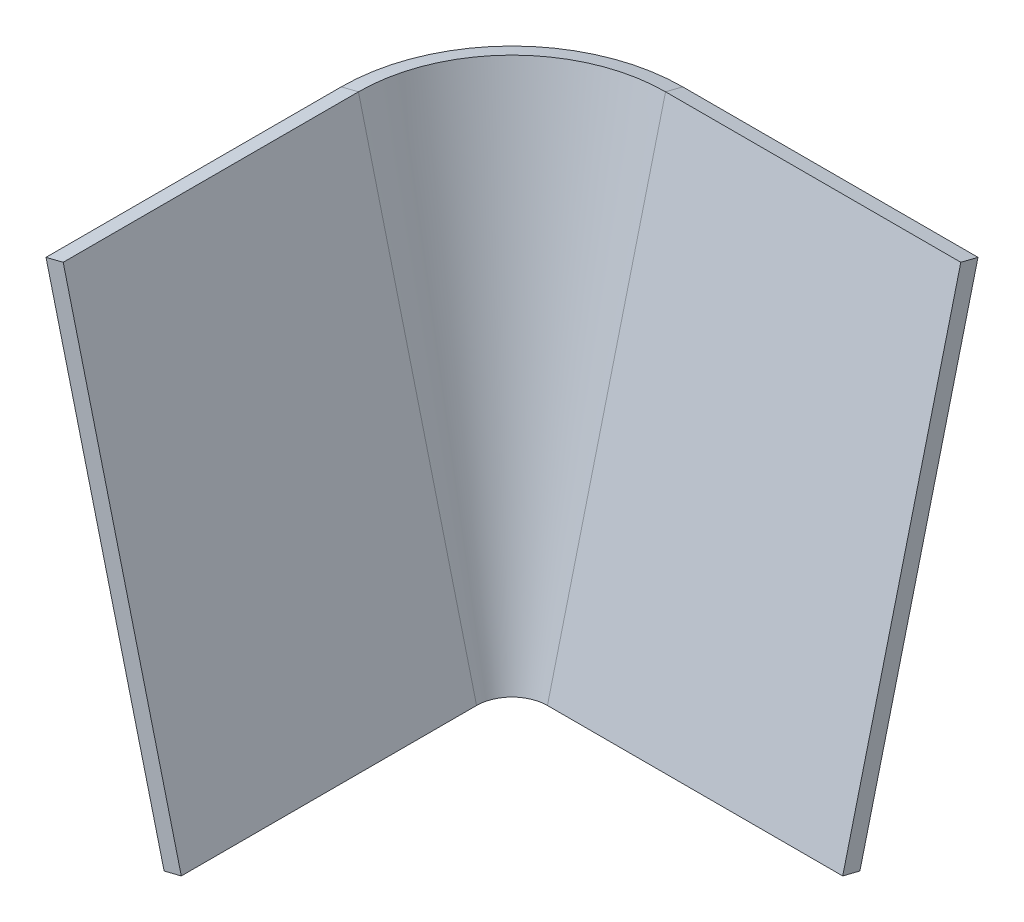
ISO-10303-21;
HEADER;
FILE_DESCRIPTION(('STEP AP214'),'2;1');
FILE_NAME('part.step','',(''),(''),'','','');
FILE_SCHEMA(('AUTOMOTIVE_DESIGN { 1 0 10303 214 1 1 1 1 }'));
ENDSEC;
DATA;
#1=APPLICATION_CONTEXT('core data for automotive mechanical design processes');
#2=APPLICATION_PROTOCOL_DEFINITION('international standard','automotive_design',2000,#1);
#3=PRODUCT_CONTEXT('',#1,'mechanical');
#4=PRODUCT('Part','Part','',(#3));
#5=PRODUCT_RELATED_PRODUCT_CATEGORY('part','',(#4));
#6=PRODUCT_DEFINITION_FORMATION('','',#4);
#7=PRODUCT_DEFINITION_CONTEXT('part definition',#1,'design');
#8=PRODUCT_DEFINITION('design','',#6,#7);
#9=PRODUCT_DEFINITION_SHAPE('','',#8);
#10=(LENGTH_UNIT() NAMED_UNIT(*) SI_UNIT(.MILLI.,.METRE.));
#11=(NAMED_UNIT(*) PLANE_ANGLE_UNIT() SI_UNIT($,.RADIAN.));
#12=(NAMED_UNIT(*) SI_UNIT($,.STERADIAN.) SOLID_ANGLE_UNIT());
#13=UNCERTAINTY_MEASURE_WITH_UNIT(LENGTH_MEASURE(1.E-05),#10,'distance_accuracy_value','');
#14=(GEOMETRIC_REPRESENTATION_CONTEXT(3) GLOBAL_UNCERTAINTY_ASSIGNED_CONTEXT((#13)) GLOBAL_UNIT_ASSIGNED_CONTEXT((#10,
#11,#12)) REPRESENTATION_CONTEXT('',''));
#15=CARTESIAN_POINT('',(0.,0.,0.));
#16=DIRECTION('',(0.,0.,1.));
#17=DIRECTION('',(1.,0.,0.));
#18=AXIS2_PLACEMENT_3D('',#15,#16,#17);
#19=CARTESIAN_POINT('',(-20.,80.,56.));
#20=DIRECTION('',(0.242535625036333,-0.970142500145332,0.));
#21=DIRECTION('',(0.,0.,-1.));
#22=AXIS2_PLACEMENT_3D('',#19,#20,#21);
#23=PLANE('',#22);
#24=DIRECTION('',(-0.970142500145332,-0.242535625036333,0.));
#25=VECTOR('',#24,1.);
#26=CARTESIAN_POINT('',(-20.,80.,56.));
#27=LINE('',#26,#25);
#28=CARTESIAN_POINT('',(-20.,80.,56.));
#29=VERTEX_POINT('',#28);
#30=CARTESIAN_POINT('',(-22.910427500436,79.272393124891,56.));
#31=VERTEX_POINT('',#30);
#32=EDGE_CURVE('E12',#29,#31,#27,.T.);
#33=ORIENTED_EDGE('',*,*,#32,.F.);
#34=DIRECTION('',(0.,0.,-1.));
#35=VECTOR('',#34,1.);
#36=CARTESIAN_POINT('',(-20.,80.,56.));
#37=LINE('',#36,#35);
#38=CARTESIAN_POINT('',(-20.,80.,6.00000000000016));
#39=VERTEX_POINT('',#38);
#40=EDGE_CURVE('E146',#29,#39,#37,.T.);
#41=ORIENTED_EDGE('',*,*,#40,.T.);
#42=DIRECTION('',(-0.970142500145332,-0.242535625036333,0.));
#43=VECTOR('',#42,1.);
#44=CARTESIAN_POINT('',(-20.,80.,6.00000000000016));
#45=LINE('',#44,#43);
#46=CARTESIAN_POINT('',(-22.910427500436,79.272393124891,6.00000000000016));
#47=VERTEX_POINT('',#46);
#48=EDGE_CURVE('E55',#39,#47,#45,.T.);
#49=ORIENTED_EDGE('',*,*,#48,.T.);
#50=DIRECTION('',(0.,0.,1.));
#51=VECTOR('',#50,1.);
#52=CARTESIAN_POINT('',(-22.910427500436,79.272393124891,0.));
#53=LINE('',#52,#51);
#54=EDGE_CURVE('E144',#31,#47,#53,.F.);
#55=ORIENTED_EDGE('',*,*,#54,.F.);
#56=EDGE_LOOP('',(#33,#41,#49,#55));
#57=FACE_BOUND('',#56,.T.);
#58=ADVANCED_FACE('F45',(#57),#23,.F.);
#59=CARTESIAN_POINT('',(6.,80.,6.));
#60=DIRECTION('',(0.,-1.,0.));
#61=DIRECTION('',(0.,0.,-1.));
#62=AXIS2_PLACEMENT_3D('',#59,#60,#61);
#63=CONICAL_SURFACE('',#62,26.,1.32581766366803);
#64=ORIENTED_EDGE('',*,*,#48,.F.);
#65=CARTESIAN_POINT('',(6.,80.,6.));
#66=DIRECTION('',(0.,-1.,0.));
#67=DIRECTION('',(0.,0.,-1.));
#68=AXIS2_PLACEMENT_3D('',#65,#66,#67);
#69=CIRCLE('',#68,26.);
#70=CARTESIAN_POINT('',(6.00000000000004,80.,-20.));
#71=VERTEX_POINT('',#70);
#72=EDGE_CURVE('E129',#39,#71,#69,.T.);
#73=ORIENTED_EDGE('',*,*,#72,.T.);
#74=DIRECTION('',(0.,-0.242535625036333,-0.970142500145332));
#75=VECTOR('',#74,1.);
#76=CARTESIAN_POINT('',(6.00000000000004,80.,-20.));
#77=LINE('',#76,#75);
#78=CARTESIAN_POINT('',(6.00000000000004,79.272393124891,-22.910427500436));
#79=VERTEX_POINT('',#78);
#80=EDGE_CURVE('E138',#71,#79,#77,.T.);
#81=ORIENTED_EDGE('',*,*,#80,.T.);
#82=CARTESIAN_POINT('',(6.,79.272393124891,6.));
#83=DIRECTION('',(0.,1.,0.));
#84=DIRECTION('',(0.,0.,1.));
#85=AXIS2_PLACEMENT_3D('',#82,#83,#84);
#86=CIRCLE('',#85,28.910427500436);
#87=EDGE_CURVE('E163',#47,#79,#86,.F.);
#88=ORIENTED_EDGE('',*,*,#87,.F.);
#89=EDGE_LOOP('',(#64,#73,#81,#88));
#90=FACE_BOUND('',#89,.T.);
#91=ADVANCED_FACE('F164',(#90),#63,.T.);
#92=CARTESIAN_POINT('',(6.00000000000004,80.,-20.));
#93=DIRECTION('',(0.,-0.970142500145332,0.242535625036333));
#94=DIRECTION('',(1.,0.,0.));
#95=AXIS2_PLACEMENT_3D('',#92,#93,#94);
#96=PLANE('',#95);
#97=ORIENTED_EDGE('',*,*,#80,.F.);
#98=DIRECTION('',(1.,0.,0.));
#99=VECTOR('',#98,1.);
#100=CARTESIAN_POINT('',(6.00000000000004,80.,-20.));
#101=LINE('',#100,#99);
#102=CARTESIAN_POINT('',(56.,80.,-20.));
#103=VERTEX_POINT('',#102);
#104=EDGE_CURVE('E124',#71,#103,#101,.T.);
#105=ORIENTED_EDGE('',*,*,#104,.T.);
#106=DIRECTION('',(0.,-0.242535625036333,-0.970142500145332));
#107=VECTOR('',#106,1.);
#108=CARTESIAN_POINT('',(56.,80.,-20.));
#109=LINE('',#108,#107);
#110=CARTESIAN_POINT('',(56.,79.272393124891,-22.910427500436));
#111=VERTEX_POINT('',#110);
#112=EDGE_CURVE('E102',#103,#111,#109,.T.);
#113=ORIENTED_EDGE('',*,*,#112,.T.);
#114=DIRECTION('',(1.,0.,0.));
#115=VECTOR('',#114,1.);
#116=CARTESIAN_POINT('',(0.,79.272393124891,-22.910427500436));
#117=LINE('',#116,#115);
#118=EDGE_CURVE('E182',#79,#111,#117,.T.);
#119=ORIENTED_EDGE('',*,*,#118,.F.);
#120=EDGE_LOOP('',(#97,#105,#113,#119));
#121=FACE_BOUND('',#120,.T.);
#122=ADVANCED_FACE('F201',(#121),#96,.F.);
#123=CARTESIAN_POINT('',(56.,80.,-20.));
#124=DIRECTION('',(-1.,0.,0.));
#125=DIRECTION('',(0.,-0.970142500145332,0.242535625036333));
#126=AXIS2_PLACEMENT_3D('',#123,#124,#125);
#127=PLANE('',#126);
#128=ORIENTED_EDGE('',*,*,#112,.F.);
#129=DIRECTION('',(0.,-0.970142500145332,0.242535625036333));
#130=VECTOR('',#129,1.);
#131=CARTESIAN_POINT('',(56.,80.,-20.));
#132=LINE('',#131,#130);
#133=CARTESIAN_POINT('',(56.,0.,0.));
#134=VERTEX_POINT('',#133);
#135=EDGE_CURVE('E119',#103,#134,#132,.T.);
#136=ORIENTED_EDGE('',*,*,#135,.T.);
#137=DIRECTION('',(0.,-0.242535625036333,-0.970142500145332));
#138=VECTOR('',#137,1.);
#139=CARTESIAN_POINT('',(56.,0.,0.));
#140=LINE('',#139,#138);
#141=CARTESIAN_POINT('',(56.,-0.727606875108999,-2.910427500436));
#142=VERTEX_POINT('',#141);
#143=EDGE_CURVE('E63',#134,#142,#140,.T.);
#144=ORIENTED_EDGE('',*,*,#143,.T.);
#145=DIRECTION('',(0.,-0.970142500145332,0.242535625036333));
#146=VECTOR('',#145,1.);
#147=CARTESIAN_POINT('',(56.,-0.727606875108999,-2.910427500436));
#148=LINE('',#147,#146);
#149=EDGE_CURVE('E180',#111,#142,#148,.T.);
#150=ORIENTED_EDGE('',*,*,#149,.F.);
#151=EDGE_LOOP('',(#128,#136,#144,#150));
#152=FACE_BOUND('',#151,.T.);
#153=ADVANCED_FACE('F126',(#152),#127,.F.);
#154=CARTESIAN_POINT('',(6.00000000000004,0.,0.));
#155=DIRECTION('',(0.,-0.970142500145332,0.242535625036333));
#156=DIRECTION('',(1.,0.,0.));
#157=AXIS2_PLACEMENT_3D('',#154,#155,#156);
#158=PLANE('',#157);
#159=ORIENTED_EDGE('',*,*,#143,.F.);
#160=DIRECTION('',(1.,0.,0.));
#161=VECTOR('',#160,1.);
#162=CARTESIAN_POINT('',(6.00000000000004,0.,0.));
#163=LINE('',#162,#161);
#164=CARTESIAN_POINT('',(6.,0.,0.));
#165=VERTEX_POINT('',#164);
#166=EDGE_CURVE('E110',#165,#134,#163,.T.);
#167=ORIENTED_EDGE('',*,*,#166,.F.);
#168=DIRECTION('',(0.,-0.242535625036333,-0.970142500145332));
#169=VECTOR('',#168,1.);
#170=CARTESIAN_POINT('',(6.,0.,0.));
#171=LINE('',#170,#169);
#172=CARTESIAN_POINT('',(6.00000000000001,-0.727606875108985,-2.910427500436));
#173=VERTEX_POINT('',#172);
#174=EDGE_CURVE('E113',#165,#173,#171,.T.);
#175=ORIENTED_EDGE('',*,*,#174,.T.);
#176=DIRECTION('',(1.,0.,0.));
#177=VECTOR('',#176,1.);
#178=CARTESIAN_POINT('',(0.,-0.727606875108985,-2.910427500436));
#179=LINE('',#178,#177);
#180=EDGE_CURVE('E112',#173,#142,#179,.T.);
#181=ORIENTED_EDGE('',*,*,#180,.T.);
#182=EDGE_LOOP('',(#159,#167,#175,#181));
#183=FACE_BOUND('',#182,.T.);
#184=ADVANCED_FACE('F108',(#183),#158,.T.);
#185=CARTESIAN_POINT('',(6.,0.,6.));
#186=DIRECTION('',(0.,-1.,0.));
#187=DIRECTION('',(0.,0.,-1.));
#188=AXIS2_PLACEMENT_3D('',#185,#186,#187);
#189=CONICAL_SURFACE('',#188,6.,1.32581766366803);
#190=ORIENTED_EDGE('',*,*,#174,.F.);
#191=CARTESIAN_POINT('',(6.,0.,6.));
#192=DIRECTION('',(0.,-1.,0.));
#193=DIRECTION('',(0.,0.,-1.));
#194=AXIS2_PLACEMENT_3D('',#191,#192,#193);
#195=CIRCLE('',#194,6.);
#196=CARTESIAN_POINT('',(0.,0.,6.00000000000004));
#197=VERTEX_POINT('',#196);
#198=EDGE_CURVE('E127',#197,#165,#195,.T.);
#199=ORIENTED_EDGE('',*,*,#198,.F.);
#200=DIRECTION('',(-0.970142500145332,-0.242535625036333,0.));
#201=VECTOR('',#200,1.);
#202=CARTESIAN_POINT('',(0.,0.,6.00000000000004));
#203=LINE('',#202,#201);
#204=CARTESIAN_POINT('',(-2.910427500436,-0.727606875108999,6.00000000000005));
#205=VERTEX_POINT('',#204);
#206=EDGE_CURVE('E133',#197,#205,#203,.T.);
#207=ORIENTED_EDGE('',*,*,#206,.T.);
#208=CARTESIAN_POINT('',(6.,-0.727606875109005,6.));
#209=DIRECTION('',(0.,1.,0.));
#210=DIRECTION('',(0.,0.,1.));
#211=AXIS2_PLACEMENT_3D('',#208,#209,#210);
#212=CIRCLE('',#211,8.910427500436);
#213=EDGE_CURVE('E168',#205,#173,#212,.F.);
#214=ORIENTED_EDGE('',*,*,#213,.T.);
#215=EDGE_LOOP('',(#190,#199,#207,#214));
#216=FACE_BOUND('',#215,.T.);
#217=ADVANCED_FACE('F206',(#216),#189,.F.);
#218=CARTESIAN_POINT('',(0.,0.,6.00000000000004));
#219=DIRECTION('',(0.242535625036333,-0.970142500145332,0.));
#220=DIRECTION('',(0.,0.,-1.));
#221=AXIS2_PLACEMENT_3D('',#218,#219,#220);
#222=PLANE('',#221);
#223=ORIENTED_EDGE('',*,*,#206,.F.);
#224=DIRECTION('',(0.,0.,-1.));
#225=VECTOR('',#224,1.);
#226=CARTESIAN_POINT('',(0.,0.,6.00000000000004));
#227=LINE('',#226,#225);
#228=CARTESIAN_POINT('',(0.,0.,56.));
#229=VERTEX_POINT('',#228);
#230=EDGE_CURVE('E191',#229,#197,#227,.T.);
#231=ORIENTED_EDGE('',*,*,#230,.F.);
#232=DIRECTION('',(-0.970142500145332,-0.242535625036333,0.));
#233=VECTOR('',#232,1.);
#234=CARTESIAN_POINT('',(0.,0.,56.));
#235=LINE('',#234,#233);
#236=CARTESIAN_POINT('',(-2.91042750043599,-0.727606875108985,56.));
#237=VERTEX_POINT('',#236);
#238=EDGE_CURVE('E49',#229,#237,#235,.T.);
#239=ORIENTED_EDGE('',*,*,#238,.T.);
#240=DIRECTION('',(0.,0.,1.));
#241=VECTOR('',#240,1.);
#242=CARTESIAN_POINT('',(-2.910427500436,-0.727606875108987,0.));
#243=LINE('',#242,#241);
#244=EDGE_CURVE('E174',#237,#205,#243,.F.);
#245=ORIENTED_EDGE('',*,*,#244,.T.);
#246=EDGE_LOOP('',(#223,#231,#239,#245));
#247=FACE_BOUND('',#246,.T.);
#248=ADVANCED_FACE('F233',(#247),#222,.T.);
#249=CARTESIAN_POINT('',(-20.,80.,56.));
#250=DIRECTION('',(0.,0.,1.));
#251=DIRECTION('',(0.242535625036333,-0.970142500145332,0.));
#252=AXIS2_PLACEMENT_3D('',#249,#250,#251);
#253=PLANE('',#252);
#254=DIRECTION('',(0.242535625036333,-0.970142500145332,0.));
#255=VECTOR('',#254,1.);
#256=CARTESIAN_POINT('',(-20.,80.,56.));
#257=LINE('',#256,#255);
#258=EDGE_CURVE('E188',#29,#229,#257,.T.);
#259=ORIENTED_EDGE('',*,*,#258,.F.);
#260=ORIENTED_EDGE('',*,*,#32,.T.);
#261=DIRECTION('',(-0.242535625036333,0.970142500145332,0.));
#262=VECTOR('',#261,1.);
#263=CARTESIAN_POINT('',(-2.91042750043599,-0.727606875108998,56.));
#264=LINE('',#263,#262);
#265=EDGE_CURVE('E159',#31,#237,#264,.F.);
#266=ORIENTED_EDGE('',*,*,#265,.T.);
#267=ORIENTED_EDGE('',*,*,#238,.F.);
#268=EDGE_LOOP('',(#259,#260,#266,#267));
#269=FACE_BOUND('',#268,.T.);
#270=ADVANCED_FACE('F47',(#269),#253,.T.);
#271=CARTESIAN_POINT('',(-2.910427500436,-0.727606875108999,0.));
#272=DIRECTION('',(0.970142500145332,0.242535625036333,0.));
#273=DIRECTION('',(-0.242535625036333,0.970142500145332,0.));
#274=AXIS2_PLACEMENT_3D('',#271,#272,#273);
#275=PLANE('',#274);
#276=DIRECTION('',(-0.242535625036333,0.970142500145332,0.));
#277=VECTOR('',#276,1.);
#278=CARTESIAN_POINT('',(-2.910427500436,-0.727606875108999,6.00000000000016));
#279=LINE('',#278,#277);
#280=EDGE_CURVE('E157',#47,#205,#279,.F.);
#281=ORIENTED_EDGE('',*,*,#280,.T.);
#282=ORIENTED_EDGE('',*,*,#244,.F.);
#283=ORIENTED_EDGE('',*,*,#265,.F.);
#284=ORIENTED_EDGE('',*,*,#54,.T.);
#285=EDGE_LOOP('',(#281,#282,#283,#284));
#286=FACE_BOUND('',#285,.T.);
#287=ADVANCED_FACE('F154',(#286),#275,.F.);
#288=CARTESIAN_POINT('',(6.,79.272393124891,6.));
#289=DIRECTION('',(0.,1.,0.));
#290=DIRECTION('',(0.,0.,1.));
#291=AXIS2_PLACEMENT_3D('',#288,#289,#290);
#292=CONICAL_SURFACE('',#291,28.910427500436,0.244978663126864);
#293=DIRECTION('',(0.,0.970142500145332,-0.242535625036333));
#294=VECTOR('',#293,1.);
#295=CARTESIAN_POINT('',(6.00000000000004,79.272393124891,-22.910427500436));
#296=LINE('',#295,#294);
#297=EDGE_CURVE('E160',#79,#173,#296,.F.);
#298=ORIENTED_EDGE('',*,*,#297,.T.);
#299=ORIENTED_EDGE('',*,*,#213,.F.);
#300=ORIENTED_EDGE('',*,*,#280,.F.);
#301=ORIENTED_EDGE('',*,*,#87,.T.);
#302=EDGE_LOOP('',(#298,#299,#300,#301));
#303=FACE_BOUND('',#302,.T.);
#304=ADVANCED_FACE('F171',(#303),#292,.T.);
#305=CARTESIAN_POINT('',(0.,-0.727606875108999,-2.910427500436));
#306=DIRECTION('',(0.,0.242535625036333,0.970142500145332));
#307=DIRECTION('',(0.,-0.970142500145332,0.242535625036333));
#308=AXIS2_PLACEMENT_3D('',#305,#306,#307);
#309=PLANE('',#308);
#310=ORIENTED_EDGE('',*,*,#149,.T.);
#311=ORIENTED_EDGE('',*,*,#180,.F.);
#312=ORIENTED_EDGE('',*,*,#297,.F.);
#313=ORIENTED_EDGE('',*,*,#118,.T.);
#314=EDGE_LOOP('',(#310,#311,#312,#313));
#315=FACE_BOUND('',#314,.T.);
#316=ADVANCED_FACE('F208',(#315),#309,.F.);
#317=CARTESIAN_POINT('',(0.,0.,0.));
#318=DIRECTION('',(0.970142500145332,0.242535625036333,0.));
#319=DIRECTION('',(-0.242535625036333,0.970142500145332,0.));
#320=AXIS2_PLACEMENT_3D('',#317,#318,#319);
#321=PLANE('',#320);
#322=DIRECTION('',(0.242535625036333,-0.970142500145332,0.));
#323=VECTOR('',#322,1.);
#324=CARTESIAN_POINT('',(-20.,80.,6.00000000000016));
#325=LINE('',#324,#323);
#326=EDGE_CURVE('E194',#39,#197,#325,.T.);
#327=ORIENTED_EDGE('',*,*,#326,.F.);
#328=ORIENTED_EDGE('',*,*,#40,.F.);
#329=ORIENTED_EDGE('',*,*,#258,.T.);
#330=ORIENTED_EDGE('',*,*,#230,.T.);
#331=EDGE_LOOP('',(#327,#328,#329,#330));
#332=FACE_BOUND('',#331,.T.);
#333=ADVANCED_FACE('F210',(#332),#321,.T.);
#334=CARTESIAN_POINT('',(6.,80.,6.));
#335=DIRECTION('',(0.,1.,0.));
#336=DIRECTION('',(0.,0.,1.));
#337=AXIS2_PLACEMENT_3D('',#334,#335,#336);
#338=CONICAL_SURFACE('',#337,26.,0.244978663126864);
#339=DIRECTION('',(0.,-0.970142500145332,0.242535625036333));
#340=VECTOR('',#339,1.);
#341=CARTESIAN_POINT('',(6.00000000000004,80.,-20.));
#342=LINE('',#341,#340);
#343=EDGE_CURVE('E122',#71,#165,#342,.T.);
#344=ORIENTED_EDGE('',*,*,#343,.F.);
#345=ORIENTED_EDGE('',*,*,#72,.F.);
#346=ORIENTED_EDGE('',*,*,#326,.T.);
#347=ORIENTED_EDGE('',*,*,#198,.T.);
#348=EDGE_LOOP('',(#344,#345,#346,#347));
#349=FACE_BOUND('',#348,.T.);
#350=ADVANCED_FACE('F203',(#349),#338,.F.);
#351=CARTESIAN_POINT('',(0.,0.,0.));
#352=DIRECTION('',(0.,0.242535625036333,0.970142500145332));
#353=DIRECTION('',(0.,-0.970142500145332,0.242535625036333));
#354=AXIS2_PLACEMENT_3D('',#351,#352,#353);
#355=PLANE('',#354);
#356=ORIENTED_EDGE('',*,*,#135,.F.);
#357=ORIENTED_EDGE('',*,*,#104,.F.);
#358=ORIENTED_EDGE('',*,*,#343,.T.);
#359=ORIENTED_EDGE('',*,*,#166,.T.);
#360=EDGE_LOOP('',(#356,#357,#358,#359));
#361=FACE_BOUND('',#360,.T.);
#362=ADVANCED_FACE('F117',(#361),#355,.T.);
#363=CLOSED_SHELL('',(#58,#91,#122,#153,#184,#217,#248,#270,#287,#304,#316,#333,#350,#362));
#364=MANIFOLD_SOLID_BREP('B2',#363);
#365=ADVANCED_BREP_SHAPE_REPRESENTATION('',(#18,#364),#14);
#366=SHAPE_DEFINITION_REPRESENTATION(#9,#365);
ENDSEC;
END-ISO-10303-21;
